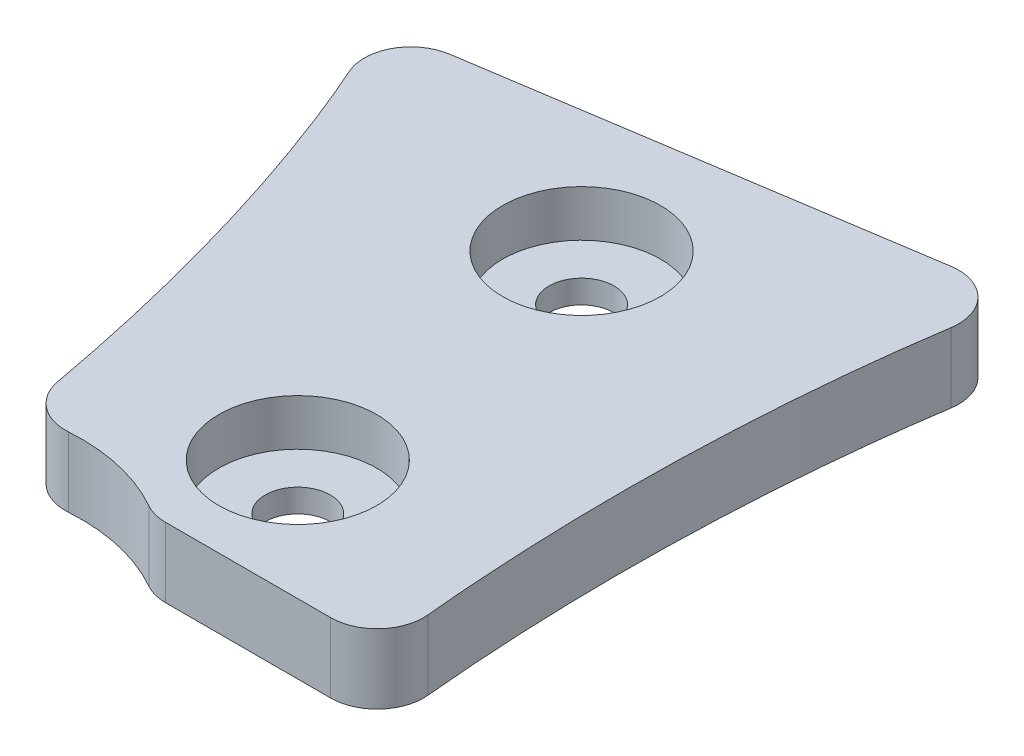
ISO-10303-21;
HEADER;
FILE_DESCRIPTION(('STEP AP214'),'2;1');
FILE_NAME('part.step','',(''),(''),'','','');
FILE_SCHEMA(('AUTOMOTIVE_DESIGN { 1 0 10303 214 1 1 1 1 }'));
ENDSEC;
DATA;
#1=APPLICATION_CONTEXT('core data for automotive mechanical design processes');
#2=APPLICATION_PROTOCOL_DEFINITION('international standard','automotive_design',2000,#1);
#3=PRODUCT_CONTEXT('',#1,'mechanical');
#4=PRODUCT('Part','Part','',(#3));
#5=PRODUCT_RELATED_PRODUCT_CATEGORY('part','',(#4));
#6=PRODUCT_DEFINITION_FORMATION('','',#4);
#7=PRODUCT_DEFINITION_CONTEXT('part definition',#1,'design');
#8=PRODUCT_DEFINITION('design','',#6,#7);
#9=PRODUCT_DEFINITION_SHAPE('','',#8);
#10=(LENGTH_UNIT() NAMED_UNIT(*) SI_UNIT(.MILLI.,.METRE.));
#11=(NAMED_UNIT(*) PLANE_ANGLE_UNIT() SI_UNIT($,.RADIAN.));
#12=(NAMED_UNIT(*) SI_UNIT($,.STERADIAN.) SOLID_ANGLE_UNIT());
#13=UNCERTAINTY_MEASURE_WITH_UNIT(LENGTH_MEASURE(1.E-05),#10,'distance_accuracy_value','');
#14=(GEOMETRIC_REPRESENTATION_CONTEXT(3) GLOBAL_UNCERTAINTY_ASSIGNED_CONTEXT((#13)) GLOBAL_UNIT_ASSIGNED_CONTEXT((#10,
#11,#12)) REPRESENTATION_CONTEXT('',''));
#15=CARTESIAN_POINT('',(0.,0.,0.));
#16=DIRECTION('',(0.,0.,1.));
#17=DIRECTION('',(1.,0.,0.));
#18=AXIS2_PLACEMENT_3D('',#15,#16,#17);
#19=CARTESIAN_POINT('',(49.8913924813645,13.5,-59.0924853869626));
#20=DIRECTION('',(0.,-1.,0.));
#21=DIRECTION('',(0.,0.,-1.));
#22=AXIS2_PLACEMENT_3D('',#19,#20,#21);
#23=CYLINDRICAL_SURFACE('',#22,0.700000000000001);
#24=CARTESIAN_POINT('',(49.8913924813645,12.,-59.0924853869626));
#25=DIRECTION('',(0.,1.,0.));
#26=DIRECTION('',(0.,0.,1.));
#27=AXIS2_PLACEMENT_3D('',#24,#25,#26);
#28=CIRCLE('',#27,0.700000000000001);
#29=CARTESIAN_POINT('',(49.8913924813645,12.,-58.3924853869626));
#30=VERTEX_POINT('',#29);
#31=EDGE_CURVE('E485',#30,#30,#28,.T.);
#32=ORIENTED_EDGE('',*,*,#31,.F.);
#33=EDGE_LOOP('',(#32));
#34=FACE_BOUND('',#33,.T.);
#35=CARTESIAN_POINT('',(49.8913924813645,12.5,-59.0924853869626));
#36=DIRECTION('',(0.,1.,0.));
#37=DIRECTION('',(0.,0.,1.));
#38=AXIS2_PLACEMENT_3D('',#35,#36,#37);
#39=CIRCLE('',#38,0.700000000000001);
#40=CARTESIAN_POINT('',(49.8913924813645,12.5,-58.3924853869626));
#41=VERTEX_POINT('',#40);
#42=EDGE_CURVE('E489',#41,#41,#39,.T.);
#43=ORIENTED_EDGE('',*,*,#42,.T.);
#44=EDGE_LOOP('',(#43));
#45=FACE_BOUND('',#44,.T.);
#46=ADVANCED_FACE('F374',(#34,#45),#23,.F.);
#47=CARTESIAN_POINT('',(49.0494062463612,13.5,-66.0453740570654));
#48=DIRECTION('',(0.,-1.,0.));
#49=DIRECTION('',(0.,0.,-1.));
#50=AXIS2_PLACEMENT_3D('',#47,#48,#49);
#51=CYLINDRICAL_SURFACE('',#50,0.700000000000023);
#52=CARTESIAN_POINT('',(49.0494062463612,12.,-66.0453740570654));
#53=DIRECTION('',(0.,1.,0.));
#54=DIRECTION('',(0.,0.,1.));
#55=AXIS2_PLACEMENT_3D('',#52,#53,#54);
#56=CIRCLE('',#55,0.700000000000023);
#57=CARTESIAN_POINT('',(49.0494062463612,12.,-65.3453740570654));
#58=VERTEX_POINT('',#57);
#59=EDGE_CURVE('E503',#58,#58,#56,.T.);
#60=ORIENTED_EDGE('',*,*,#59,.F.);
#61=EDGE_LOOP('',(#60));
#62=FACE_BOUND('',#61,.T.);
#63=CARTESIAN_POINT('',(49.0494062463612,12.5,-66.0453740570654));
#64=DIRECTION('',(0.,1.,0.));
#65=DIRECTION('',(0.,0.,1.));
#66=AXIS2_PLACEMENT_3D('',#63,#64,#65);
#67=CIRCLE('',#66,0.700000000000023);
#68=CARTESIAN_POINT('',(49.0494062463612,12.5,-65.3453740570654));
#69=VERTEX_POINT('',#68);
#70=EDGE_CURVE('E497',#69,#69,#67,.T.);
#71=ORIENTED_EDGE('',*,*,#70,.T.);
#72=EDGE_LOOP('',(#71));
#73=FACE_BOUND('',#72,.T.);
#74=ADVANCED_FACE('F589',(#62,#73),#51,.F.);
#75=CARTESIAN_POINT('',(53.9907029686988,13.5,-63.2436286120206));
#76=DIRECTION('',(0.,1.,0.));
#77=DIRECTION('',(0.,0.,1.));
#78=AXIS2_PLACEMENT_3D('',#75,#76,#77);
#79=PLANE('',#78);
#80=CARTESIAN_POINT('',(49.0494062463612,13.5,-66.0453740570654));
#81=DIRECTION('',(0.,1.,0.));
#82=DIRECTION('',(0.,0.,1.));
#83=AXIS2_PLACEMENT_3D('',#80,#81,#82);
#84=CIRCLE('',#83,1.70000000000002);
#85=CARTESIAN_POINT('',(49.0494062463612,13.5,-64.3453740570654));
#86=VERTEX_POINT('',#85);
#87=EDGE_CURVE('E505',#86,#86,#84,.T.);
#88=ORIENTED_EDGE('',*,*,#87,.F.);
#89=EDGE_LOOP('',(#88));
#90=FACE_BOUND('',#89,.T.);
#91=CARTESIAN_POINT('',(49.8913924813645,13.5,-59.0924853869626));
#92=DIRECTION('',(0.,1.,0.));
#93=DIRECTION('',(0.,0.,1.));
#94=AXIS2_PLACEMENT_3D('',#91,#92,#93);
#95=CIRCLE('',#94,1.7);
#96=CARTESIAN_POINT('',(49.8913924813645,13.5,-57.3924853869626));
#97=VERTEX_POINT('',#96);
#98=EDGE_CURVE('E515',#97,#97,#95,.T.);
#99=ORIENTED_EDGE('',*,*,#98,.F.);
#100=EDGE_LOOP('',(#99));
#101=FACE_BOUND('',#100,.T.);
#102=CARTESIAN_POINT('',(54.4554315101539,13.5,-68.5990260310877));
#103=CARTESIAN_POINT('',(54.3545266783001,13.5,-67.9382398829169));
#104=CARTESIAN_POINT('',(54.271624139511,13.5,-67.2755397016494));
#105=CARTESIAN_POINT('',(54.0904122714855,13.5,-65.4931823189875));
#106=CARTESIAN_POINT('',(54.0206159285442,13.5,-64.3698355688438));
#107=CARTESIAN_POINT('',(53.9607900088534,13.5,-62.1174216551974));
#108=CARTESIAN_POINT('',(53.9712566464364,13.5,-60.9929785765451));
#109=CARTESIAN_POINT('',(54.0558564716273,13.5,-59.1136931290327));
#110=CARTESIAN_POINT('',(54.108016376755,13.5,-58.3578909142161));
#111=CARTESIAN_POINT('',(54.1802532483283,13.5,-57.6029657096994));
#112=B_SPLINE_CURVE_WITH_KNOTS('',3,(#102,#103,#104,#105,#106,#107,#108,#109,#110,#111),
.UNSPECIFIED.,.F.,.F.,(4,2,2,2,4),(0.0815226926668174,0.230073441329148,0.480073441329148,
0.730073441329148,0.898550748662329),.UNSPECIFIED.);
#113=CARTESIAN_POINT('',(54.1802645645021,13.5,-57.6029667925153));
#114=VERTEX_POINT('',#113);
#115=CARTESIAN_POINT('',(54.455467883606,13.5,-68.5990204767081));
#116=VERTEX_POINT('',#115);
#117=EDGE_CURVE('E566',#114,#116,#112,.F.);
#118=ORIENTED_EDGE('',*,*,#117,.T.);
#119=CARTESIAN_POINT('',(53.4668907733742,13.5,-68.7499803676503));
#120=DIRECTION('',(0.,1.,0.));
#121=DIRECTION('',(0.,0.,1.));
#122=AXIS2_PLACEMENT_3D('',#119,#120,#121);
#123=CIRCLE('',#122,1.);
#124=CARTESIAN_POINT('',(53.3145344428725,13.5,-69.7383059964569));
#125=VERTEX_POINT('',#124);
#126=EDGE_CURVE('E673',#116,#125,#123,.T.);
#127=ORIENTED_EDGE('',*,*,#126,.T.);
#128=DIRECTION('',(-0.988325628806664,0.,0.152356330501599));
#129=VECTOR('',#128,1.);
#130=CARTESIAN_POINT('',(54.6881930936967,13.5,-69.9500637261984));
#131=LINE('',#130,#129);
#132=CARTESIAN_POINT('',(43.9579178396539,13.5,-68.295927361292));
#133=VERTEX_POINT('',#132);
#134=EDGE_CURVE('E473',#125,#133,#131,.T.);
#135=ORIENTED_EDGE('',*,*,#134,.T.);
#136=CARTESIAN_POINT('',(44.1102741701555,13.5,-67.3076017324853));
#137=DIRECTION('',(0.,1.,0.));
#138=DIRECTION('',(0.,0.,1.));
#139=AXIS2_PLACEMENT_3D('',#136,#137,#138);
#140=CIRCLE('',#139,1.);
#141=CARTESIAN_POINT('',(43.1958168084121,13.5,-66.9026871975463));
#142=VERTEX_POINT('',#141);
#143=EDGE_CURVE('E719',#133,#142,#140,.T.);
#144=ORIENTED_EDGE('',*,*,#143,.T.);
#145=CARTESIAN_POINT('',(45.8459208388537,13.5,-57.967576905918));
#146=CARTESIAN_POINT('',(45.5534349954706,13.5,-59.5718323272755));
#147=CARTESIAN_POINT('',(45.1790006364089,13.5,-61.1600553445394));
#148=CARTESIAN_POINT('',(44.4352139604292,13.5,-63.6641010179501));
#149=CARTESIAN_POINT('',(44.1234133913989,13.5,-64.5925800214781));
#150=CARTESIAN_POINT('',(43.5913922741165,13.5,-65.9755087098045));
#151=CARTESIAN_POINT('',(43.4000706027265,13.5,-66.4416334675884));
#152=CARTESIAN_POINT('',(43.195902776793,13.5,-66.9027252636702));
#153=B_SPLINE_CURVE_WITH_KNOTS('',3,(#145,#146,#147,#148,#149,#150,#151,#152),.UNSPECIFIED.,.F.,
.F.,(4,2,2,4),(0.121205951813133,0.53684669898772,0.78684669898772,0.915640747174587),.UNSPECIFIED.);
#154=CARTESIAN_POINT('',(45.8459266689806,13.5,-57.9675779688594));
#155=VERTEX_POINT('',#154);
#156=EDGE_CURVE('E611',#142,#155,#153,.F.);
#157=ORIENTED_EDGE('',*,*,#156,.T.);
#158=CARTESIAN_POINT('',(46.8297039620861,13.5,-58.1469390157493));
#159=DIRECTION('',(0.,1.,0.));
#160=DIRECTION('',(0.,0.,1.));
#161=AXIS2_PLACEMENT_3D('',#158,#159,#160);
#162=CIRCLE('',#161,1.);
#163=CARTESIAN_POINT('',(46.8968852972062,13.5,-57.1491982336764));
#164=VERTEX_POINT('',#163);
#165=EDGE_CURVE('E722',#155,#164,#162,.T.);
#166=ORIENTED_EDGE('',*,*,#165,.T.);
#167=CARTESIAN_POINT('',(47.1656106376869,13.5,-53.1582351053848));
#168=DIRECTION('',(0.,-1.,0.));
#169=DIRECTION('',(0.,0.,1.));
#170=AXIS2_PLACEMENT_3D('',#167,#168,#169);
#171=CIRCLE('',#170,4.00000000000001);
#172=CARTESIAN_POINT('',(49.1385538865381,13.5,-56.6378176862143));
#173=VERTEX_POINT('',#172);
#174=EDGE_CURVE('E619',#164,#173,#171,.T.);
#175=ORIENTED_EDGE('',*,*,#174,.T.);
#176=CARTESIAN_POINT('',(49.6317896987509,13.5,-57.5077133314217));
#177=DIRECTION('',(0.,1.,0.));
#178=DIRECTION('',(0.,0.,1.));
#179=AXIS2_PLACEMENT_3D('',#176,#177,#178);
#180=CIRCLE('',#179,1.);
#181=CARTESIAN_POINT('',(49.6317896987509,13.5,-56.5077133314217));
#182=VERTEX_POINT('',#181);
#183=EDGE_CURVE('E397',#173,#182,#180,.T.);
#184=ORIENTED_EDGE('',*,*,#183,.T.);
#185=DIRECTION('',(1.,0.,0.));
#186=VECTOR('',#185,1.);
#187=CARTESIAN_POINT('',(49.3521594282023,13.5,-56.5077133314217));
#188=LINE('',#187,#186);
#189=CARTESIAN_POINT('',(53.1848000930104,13.5,-56.5077133314217));
#190=VERTEX_POINT('',#189);
#191=EDGE_CURVE('E621',#182,#190,#188,.T.);
#192=ORIENTED_EDGE('',*,*,#191,.T.);
#193=CARTESIAN_POINT('',(53.1848000930104,13.5,-57.5077133314217));
#194=DIRECTION('',(0.,1.,0.));
#195=DIRECTION('',(0.,0.,1.));
#196=AXIS2_PLACEMENT_3D('',#193,#194,#195);
#197=CIRCLE('',#196,1.);
#198=EDGE_CURVE('E675',#190,#114,#197,.T.);
#199=ORIENTED_EDGE('',*,*,#198,.T.);
#200=EDGE_LOOP('',(#118,#127,#135,#144,#157,#166,#175,#184,#192,#199));
#201=FACE_BOUND('',#200,.T.);
#202=ADVANCED_FACE('F580',(#90,#101,#201),#79,.T.);
#203=CARTESIAN_POINT('',(53.9907029686988,12.,-63.2436286120206));
#204=DIRECTION('',(0.,1.,0.));
#205=DIRECTION('',(0.,0.,1.));
#206=AXIS2_PLACEMENT_3D('',#203,#204,#205);
#207=PLANE('',#206);
#208=DIRECTION('',(-0.988325628806664,0.,0.152356330501599));
#209=VECTOR('',#208,1.);
#210=CARTESIAN_POINT('',(54.6881930936967,12.,-69.9500637261984));
#211=LINE('',#210,#209);
#212=CARTESIAN_POINT('',(53.3145344428725,12.,-69.7383059964569));
#213=VERTEX_POINT('',#212);
#214=CARTESIAN_POINT('',(43.9579178396539,12.,-68.295927361292));
#215=VERTEX_POINT('',#214);
#216=EDGE_CURVE('E470',#213,#215,#211,.T.);
#217=ORIENTED_EDGE('',*,*,#216,.F.);
#218=CARTESIAN_POINT('',(53.4668907733742,12.,-68.7499803676503));
#219=DIRECTION('',(0.,1.,0.));
#220=DIRECTION('',(0.,0.,1.));
#221=AXIS2_PLACEMENT_3D('',#218,#219,#220);
#222=CIRCLE('',#221,1.);
#223=CARTESIAN_POINT('',(54.4554725657132,12.,-68.5990197616412));
#224=VERTEX_POINT('',#223);
#225=EDGE_CURVE('E453',#213,#224,#222,.F.);
#226=ORIENTED_EDGE('',*,*,#225,.T.);
#227=CARTESIAN_POINT('',(54.1802532482786,12.,-57.6029657102187));
#228=CARTESIAN_POINT('',(54.1080163767311,12.,-58.3578909145627));
#229=CARTESIAN_POINT('',(54.0558564716195,12.,-59.1136931292061));
#230=CARTESIAN_POINT('',(53.9712566464364,12.,-60.9929785765451));
#231=CARTESIAN_POINT('',(53.9607900088534,12.,-62.1174216551974));
#232=CARTESIAN_POINT('',(54.0206159285442,12.,-64.3698355688438));
#233=CARTESIAN_POINT('',(54.0904122714855,12.,-65.4931823189875));
#234=CARTESIAN_POINT('',(54.2716241394551,12.,-67.2755397010994));
#235=CARTESIAN_POINT('',(54.3545266781628,12.,-67.9382398818197));
#236=CARTESIAN_POINT('',(54.4554315099033,12.,-68.5990260294466));
#237=B_SPLINE_CURVE_WITH_KNOTS('',3,(#227,#228,#229,#230,#231,#232,#233,#234,#235,#236),
.UNSPECIFIED.,.F.,.F.,(4,2,2,2,4),(0.0815226927054477,0.249999999999999,0.499999999999998,
0.749999999999999,0.898550748539358),.UNSPECIFIED.);
#238=CARTESIAN_POINT('',(54.1802615436658,12.,-57.602966503866));
#239=VERTEX_POINT('',#238);
#240=EDGE_CURVE('E481',#239,#224,#237,.T.);
#241=ORIENTED_EDGE('',*,*,#240,.F.);
#242=CARTESIAN_POINT('',(53.1848000930104,12.,-57.5077133314217));
#243=DIRECTION('',(0.,1.,0.));
#244=DIRECTION('',(0.,0.,1.));
#245=AXIS2_PLACEMENT_3D('',#242,#243,#244);
#246=CIRCLE('',#245,1.);
#247=CARTESIAN_POINT('',(53.1848000930104,12.,-56.5077133314217));
#248=VERTEX_POINT('',#247);
#249=EDGE_CURVE('E464',#239,#248,#246,.F.);
#250=ORIENTED_EDGE('',*,*,#249,.T.);
#251=DIRECTION('',(1.,0.,0.));
#252=VECTOR('',#251,1.);
#253=CARTESIAN_POINT('',(49.3521594282023,12.,-56.5077133314217));
#254=LINE('',#253,#252);
#255=CARTESIAN_POINT('',(49.6317896987509,12.,-56.5077133314217));
#256=VERTEX_POINT('',#255);
#257=EDGE_CURVE('E564',#256,#248,#254,.T.);
#258=ORIENTED_EDGE('',*,*,#257,.F.);
#259=CARTESIAN_POINT('',(49.6317896987509,12.,-57.5077133314217));
#260=DIRECTION('',(0.,1.,0.));
#261=DIRECTION('',(0.,0.,1.));
#262=AXIS2_PLACEMENT_3D('',#259,#260,#261);
#263=CIRCLE('',#262,1.);
#264=CARTESIAN_POINT('',(49.1385538865381,12.,-56.6378176862143));
#265=VERTEX_POINT('',#264);
#266=EDGE_CURVE('E707',#256,#265,#263,.F.);
#267=ORIENTED_EDGE('',*,*,#266,.T.);
#268=CARTESIAN_POINT('',(47.1656106376869,12.,-53.1582351053848));
#269=DIRECTION('',(0.,-1.,0.));
#270=DIRECTION('',(0.,0.,1.));
#271=AXIS2_PLACEMENT_3D('',#268,#269,#270);
#272=CIRCLE('',#271,4.00000000000001);
#273=CARTESIAN_POINT('',(46.8968852972062,12.,-57.1491982336764));
#274=VERTEX_POINT('',#273);
#275=EDGE_CURVE('E484',#274,#265,#272,.T.);
#276=ORIENTED_EDGE('',*,*,#275,.F.);
#277=CARTESIAN_POINT('',(46.8297039620861,12.,-58.1469390157493));
#278=DIRECTION('',(0.,1.,0.));
#279=DIRECTION('',(0.,0.,1.));
#280=AXIS2_PLACEMENT_3D('',#277,#278,#279);
#281=CIRCLE('',#280,1.);
#282=CARTESIAN_POINT('',(45.8459250469996,12.,-57.9675776733775));
#283=VERTEX_POINT('',#282);
#284=EDGE_CURVE('E701',#274,#283,#281,.F.);
#285=ORIENTED_EDGE('',*,*,#284,.T.);
#286=CARTESIAN_POINT('',(43.1959027777842,12.,-66.9027252614316));
#287=CARTESIAN_POINT('',(43.4000706033457,12.,-66.4416334660797));
#288=CARTESIAN_POINT('',(43.5913922744092,12.,-65.9755087090435));
#289=CARTESIAN_POINT('',(44.1234133913989,12.,-64.5925800214781));
#290=CARTESIAN_POINT('',(44.4352139604292,12.,-63.6641010179501));
#291=CARTESIAN_POINT('',(45.1790006363814,12.,-61.1600553446319));
#292=CARTESIAN_POINT('',(45.5534349954263,12.,-59.5718323274636));
#293=CARTESIAN_POINT('',(45.8459208388017,12.,-57.9675769062029));
#294=B_SPLINE_CURVE_WITH_KNOTS('',3,(#286,#287,#288,#289,#290,#291,#292,#293),.UNSPECIFIED.,.F.,
.F.,(4,2,2,4),(0.121205952021565,0.25,0.5,0.915640747149978),.UNSPECIFIED.);
#295=CARTESIAN_POINT('',(43.1958228972712,12.,-66.9026898910082));
#296=VERTEX_POINT('',#295);
#297=EDGE_CURVE('E480',#296,#283,#294,.T.);
#298=ORIENTED_EDGE('',*,*,#297,.F.);
#299=CARTESIAN_POINT('',(44.1102741701555,12.,-67.3076017324853));
#300=DIRECTION('',(0.,1.,0.));
#301=DIRECTION('',(0.,0.,1.));
#302=AXIS2_PLACEMENT_3D('',#299,#300,#301);
#303=CIRCLE('',#302,1.);
#304=EDGE_CURVE('E474',#296,#215,#303,.F.);
#305=ORIENTED_EDGE('',*,*,#304,.T.);
#306=EDGE_LOOP('',(#217,#226,#241,#250,#258,#267,#276,#285,#298,#305));
#307=FACE_BOUND('',#306,.T.);
#308=ORIENTED_EDGE('',*,*,#31,.T.);
#309=EDGE_LOOP('',(#308));
#310=FACE_BOUND('',#309,.T.);
#311=ORIENTED_EDGE('',*,*,#59,.T.);
#312=EDGE_LOOP('',(#311));
#313=FACE_BOUND('',#312,.T.);
#314=ADVANCED_FACE('F477',(#307,#310,#313),#207,.F.);
#315=CARTESIAN_POINT('',(54.2994414012508,13.5,-56.5077133314217));
#316=CARTESIAN_POINT('',(54.1627325827121,13.5,-57.6266418472396));
#317=CARTESIAN_POINT('',(54.0723371873742,13.5,-58.7475934450448));
#318=CARTESIAN_POINT('',(53.9712566464364,13.5,-60.9929785765451));
#319=CARTESIAN_POINT('',(53.9607900088534,13.5,-62.1174216551974));
#320=CARTESIAN_POINT('',(54.0206159285442,13.5,-64.3698355688438));
#321=CARTESIAN_POINT('',(54.0904122714855,13.5,-65.4931823189875));
#322=CARTESIAN_POINT('',(54.3177507831226,13.5,-67.7292305369924));
#323=CARTESIAN_POINT('',(54.4749230649993,13.5,-68.8426293334649));
#324=CARTESIAN_POINT('',(54.6881930936967,13.5,-69.9500637261983));
#325=B_SPLINE_CURVE_WITH_KNOTS('',3,(#315,#316,#317,#318,#319,#320,#321,#322,#323,#324),
.UNSPECIFIED.,.F.,.F.,(4,2,2,2,4),(0.,0.249999999999999,0.499999999999998,0.749999999999999,1.),.UNSPECIFIED.);
#326=DIRECTION('',(0.,-1.,0.));
#327=VECTOR('',#326,1.);
#328=SURFACE_OF_LINEAR_EXTRUSION('',#325,#327);
#329=ORIENTED_EDGE('',*,*,#240,.T.);
#330=DIRECTION('',(0.,-1.,0.));
#331=VECTOR('',#330,1.);
#332=CARTESIAN_POINT('',(54.455431509666,12.,-68.599026027893));
#333=LINE('',#332,#331);
#334=EDGE_CURVE('E458',#224,#116,#333,.F.);
#335=ORIENTED_EDGE('',*,*,#334,.T.);
#336=ORIENTED_EDGE('',*,*,#117,.F.);
#337=DIRECTION('',(0.,-1.,0.));
#338=VECTOR('',#337,1.);
#339=CARTESIAN_POINT('',(54.1802532482564,13.5,-57.6029657104511));
#340=LINE('',#339,#338);
#341=EDGE_CURVE('E463',#114,#239,#340,.T.);
#342=ORIENTED_EDGE('',*,*,#341,.T.);
#343=EDGE_LOOP('',(#329,#335,#336,#342));
#344=FACE_BOUND('',#343,.T.);
#345=ADVANCED_FACE('F534',(#344),#328,.F.);
#346=CARTESIAN_POINT('',(54.6881930936967,13.5,-69.9500637261984));
#347=DIRECTION('',(0.152356330501599,0.,0.988325628806664));
#348=DIRECTION('',(0.988325628806664,0.,-0.152356330501599));
#349=AXIS2_PLACEMENT_3D('',#346,#347,#348);
#350=PLANE('',#349);
#351=ORIENTED_EDGE('',*,*,#134,.F.);
#352=DIRECTION('',(0.,-1.,0.));
#353=VECTOR('',#352,1.);
#354=CARTESIAN_POINT('',(53.3145344428725,13.5,-69.7383059964569));
#355=LINE('',#354,#353);
#356=EDGE_CURVE('E457',#125,#213,#355,.T.);
#357=ORIENTED_EDGE('',*,*,#356,.T.);
#358=ORIENTED_EDGE('',*,*,#216,.T.);
#359=DIRECTION('',(0.,-1.,0.));
#360=VECTOR('',#359,1.);
#361=CARTESIAN_POINT('',(43.9579178396539,13.5,-68.295927361292));
#362=LINE('',#361,#360);
#363=EDGE_CURVE('E475',#215,#133,#362,.F.);
#364=ORIENTED_EDGE('',*,*,#363,.T.);
#365=EDGE_LOOP('',(#351,#357,#358,#364));
#366=FACE_BOUND('',#365,.T.);
#367=ADVANCED_FACE('F469',(#366),#350,.F.);
#368=CARTESIAN_POINT('',(42.5833399463783,13.5,-68.1903413702174));
#369=CARTESIAN_POINT('',(43.0307351532528,13.5,-67.3153394962351));
#370=CARTESIAN_POINT('',(43.4211569543865,13.5,-66.4180161588011));
#371=CARTESIAN_POINT('',(44.1234133913989,13.5,-64.5925800214781));
#372=CARTESIAN_POINT('',(44.4352139604292,13.5,-63.6641010179501));
#373=CARTESIAN_POINT('',(45.2732636281405,13.5,-60.8427078519974));
#374=CARTESIAN_POINT('',(45.7017193246304,13.5,-58.9261195940438));
#375=CARTESIAN_POINT('',(46.0139514081713,13.5,-56.9888592084614));
#376=B_SPLINE_CURVE_WITH_KNOTS('',3,(#368,#369,#370,#371,#372,#373,#374,#375),.UNSPECIFIED.,.F.,
.F.,(4,2,2,4),(0.,0.25,0.5,1.),.UNSPECIFIED.);
#377=DIRECTION('',(0.,-1.,0.));
#378=VECTOR('',#377,1.);
#379=SURFACE_OF_LINEAR_EXTRUSION('',#376,#378);
#380=ORIENTED_EDGE('',*,*,#297,.T.);
#381=DIRECTION('',(0.,-1.,0.));
#382=VECTOR('',#381,1.);
#383=CARTESIAN_POINT('',(45.8459208387914,12.,-57.9675769062598));
#384=LINE('',#383,#382);
#385=EDGE_CURVE('E12',#283,#155,#384,.F.);
#386=ORIENTED_EDGE('',*,*,#385,.T.);
#387=ORIENTED_EDGE('',*,*,#156,.F.);
#388=DIRECTION('',(0.,-1.,0.));
#389=VECTOR('',#388,1.);
#390=CARTESIAN_POINT('',(43.1959027777859,13.5,-66.9027252614277));
#391=LINE('',#390,#389);
#392=EDGE_CURVE('E383',#142,#296,#391,.T.);
#393=ORIENTED_EDGE('',*,*,#392,.T.);
#394=EDGE_LOOP('',(#380,#386,#387,#393));
#395=FACE_BOUND('',#394,.T.);
#396=ADVANCED_FACE('F626',(#395),#379,.F.);
#397=CARTESIAN_POINT('',(47.1656106376869,13.5,-53.1582351053848));
#398=DIRECTION('',(0.,-1.,0.));
#399=DIRECTION('',(0.,0.,-1.));
#400=AXIS2_PLACEMENT_3D('',#397,#398,#399);
#401=CYLINDRICAL_SURFACE('',#400,4.00000000000001);
#402=ORIENTED_EDGE('',*,*,#275,.T.);
#403=DIRECTION('',(0.,-1.,0.));
#404=VECTOR('',#403,1.);
#405=CARTESIAN_POINT('',(49.1385538865381,13.5,-56.6378176862143));
#406=LINE('',#405,#404);
#407=EDGE_CURVE('E693',#265,#173,#406,.F.);
#408=ORIENTED_EDGE('',*,*,#407,.T.);
#409=ORIENTED_EDGE('',*,*,#174,.F.);
#410=DIRECTION('',(0.,-1.,0.));
#411=VECTOR('',#410,1.);
#412=CARTESIAN_POINT('',(46.8968852972062,13.5,-57.1491982336764));
#413=LINE('',#412,#411);
#414=EDGE_CURVE('E690',#164,#274,#413,.T.);
#415=ORIENTED_EDGE('',*,*,#414,.T.);
#416=EDGE_LOOP('',(#402,#408,#409,#415));
#417=FACE_BOUND('',#416,.T.);
#418=ADVANCED_FACE('F635',(#417),#401,.F.);
#419=CARTESIAN_POINT('',(49.3521594282023,13.5,-56.5077133314217));
#420=DIRECTION('',(0.,0.,-1.));
#421=DIRECTION('',(-1.,0.,0.));
#422=AXIS2_PLACEMENT_3D('',#419,#420,#421);
#423=PLANE('',#422);
#424=ORIENTED_EDGE('',*,*,#257,.T.);
#425=DIRECTION('',(0.,-1.,0.));
#426=VECTOR('',#425,1.);
#427=CARTESIAN_POINT('',(53.1848000930104,13.5,-56.5077133314217));
#428=LINE('',#427,#426);
#429=EDGE_CURVE('E390',#248,#190,#428,.F.);
#430=ORIENTED_EDGE('',*,*,#429,.T.);
#431=ORIENTED_EDGE('',*,*,#191,.F.);
#432=DIRECTION('',(0.,-1.,0.));
#433=VECTOR('',#432,1.);
#434=CARTESIAN_POINT('',(49.6317896987509,13.5,-56.5077133314217));
#435=LINE('',#434,#433);
#436=EDGE_CURVE('E679',#182,#256,#435,.T.);
#437=ORIENTED_EDGE('',*,*,#436,.T.);
#438=EDGE_LOOP('',(#424,#430,#431,#437));
#439=FACE_BOUND('',#438,.T.);
#440=ADVANCED_FACE('F638',(#439),#423,.F.);
#441=CARTESIAN_POINT('',(49.0494062463612,12.5,-66.0453740570654));
#442=DIRECTION('',(0.,1.,0.));
#443=DIRECTION('',(0.,0.,1.));
#444=AXIS2_PLACEMENT_3D('',#441,#442,#443);
#445=CYLINDRICAL_SURFACE('',#444,1.70000000000002);
#446=CARTESIAN_POINT('',(49.0494062463612,12.5,-66.0453740570654));
#447=DIRECTION('',(0.,1.,0.));
#448=DIRECTION('',(0.,0.,1.));
#449=AXIS2_PLACEMENT_3D('',#446,#447,#448);
#450=CIRCLE('',#449,1.70000000000002);
#451=CARTESIAN_POINT('',(49.0494062463612,12.5,-64.3453740570654));
#452=VERTEX_POINT('',#451);
#453=EDGE_CURVE('E499',#452,#452,#450,.T.);
#454=ORIENTED_EDGE('',*,*,#453,.F.);
#455=EDGE_LOOP('',(#454));
#456=FACE_BOUND('',#455,.T.);
#457=ORIENTED_EDGE('',*,*,#87,.T.);
#458=EDGE_LOOP('',(#457));
#459=FACE_BOUND('',#458,.T.);
#460=ADVANCED_FACE('F641',(#456,#459),#445,.F.);
#461=CARTESIAN_POINT('',(49.0494062463612,12.5,-66.0453740570654));
#462=DIRECTION('',(0.,1.,0.));
#463=DIRECTION('',(0.,0.,1.));
#464=AXIS2_PLACEMENT_3D('',#461,#462,#463);
#465=PLANE('',#464);
#466=ORIENTED_EDGE('',*,*,#70,.F.);
#467=EDGE_LOOP('',(#466));
#468=FACE_BOUND('',#467,.T.);
#469=ORIENTED_EDGE('',*,*,#453,.T.);
#470=EDGE_LOOP('',(#469));
#471=FACE_BOUND('',#470,.T.);
#472=ADVANCED_FACE('F646',(#468,#471),#465,.T.);
#473=CARTESIAN_POINT('',(49.8913924813645,12.5,-59.0924853869626));
#474=DIRECTION('',(0.,1.,0.));
#475=DIRECTION('',(0.,0.,1.));
#476=AXIS2_PLACEMENT_3D('',#473,#474,#475);
#477=CYLINDRICAL_SURFACE('',#476,1.7);
#478=CARTESIAN_POINT('',(49.8913924813645,12.5,-59.0924853869626));
#479=DIRECTION('',(0.,1.,0.));
#480=DIRECTION('',(0.,0.,1.));
#481=AXIS2_PLACEMENT_3D('',#478,#479,#480);
#482=CIRCLE('',#481,1.7);
#483=CARTESIAN_POINT('',(49.8913924813645,12.5,-57.3924853869626));
#484=VERTEX_POINT('',#483);
#485=EDGE_CURVE('E510',#484,#484,#482,.T.);
#486=ORIENTED_EDGE('',*,*,#485,.F.);
#487=EDGE_LOOP('',(#486));
#488=FACE_BOUND('',#487,.T.);
#489=ORIENTED_EDGE('',*,*,#98,.T.);
#490=EDGE_LOOP('',(#489));
#491=FACE_BOUND('',#490,.T.);
#492=ADVANCED_FACE('F662',(#488,#491),#477,.F.);
#493=CARTESIAN_POINT('',(49.8913924813645,12.5,-59.0924853869626));
#494=DIRECTION('',(0.,1.,0.));
#495=DIRECTION('',(0.,0.,1.));
#496=AXIS2_PLACEMENT_3D('',#493,#494,#495);
#497=PLANE('',#496);
#498=ORIENTED_EDGE('',*,*,#42,.F.);
#499=EDGE_LOOP('',(#498));
#500=FACE_BOUND('',#499,.T.);
#501=ORIENTED_EDGE('',*,*,#485,.T.);
#502=EDGE_LOOP('',(#501));
#503=FACE_BOUND('',#502,.T.);
#504=ADVANCED_FACE('F659',(#500,#503),#497,.T.);
#505=CARTESIAN_POINT('',(53.4668907733742,12.75,-68.7499803676503));
#506=DIRECTION('',(0.,-1.,0.));
#507=DIRECTION('',(0.,0.,-1.));
#508=AXIS2_PLACEMENT_3D('',#505,#506,#507);
#509=CYLINDRICAL_SURFACE('',#508,1.);
#510=ORIENTED_EDGE('',*,*,#126,.F.);
#511=ORIENTED_EDGE('',*,*,#334,.F.);
#512=ORIENTED_EDGE('',*,*,#225,.F.);
#513=ORIENTED_EDGE('',*,*,#356,.F.);
#514=EDGE_LOOP('',(#510,#511,#512,#513));
#515=FACE_BOUND('',#514,.T.);
#516=ADVANCED_FACE('F456',(#515),#509,.T.);
#517=CARTESIAN_POINT('',(53.1848000930104,12.75,-57.5077133314217));
#518=DIRECTION('',(0.,-1.,0.));
#519=DIRECTION('',(0.,0.,-1.));
#520=AXIS2_PLACEMENT_3D('',#517,#518,#519);
#521=CYLINDRICAL_SURFACE('',#520,1.);
#522=ORIENTED_EDGE('',*,*,#198,.F.);
#523=ORIENTED_EDGE('',*,*,#429,.F.);
#524=ORIENTED_EDGE('',*,*,#249,.F.);
#525=ORIENTED_EDGE('',*,*,#341,.F.);
#526=EDGE_LOOP('',(#522,#523,#524,#525));
#527=FACE_BOUND('',#526,.T.);
#528=ADVANCED_FACE('F717',(#527),#521,.T.);
#529=CARTESIAN_POINT('',(49.6317896987509,13.5,-57.5077133314217));
#530=DIRECTION('',(0.,-1.,0.));
#531=DIRECTION('',(0.,0.,-1.));
#532=AXIS2_PLACEMENT_3D('',#529,#530,#531);
#533=CYLINDRICAL_SURFACE('',#532,1.);
#534=ORIENTED_EDGE('',*,*,#183,.F.);
#535=ORIENTED_EDGE('',*,*,#407,.F.);
#536=ORIENTED_EDGE('',*,*,#266,.F.);
#537=ORIENTED_EDGE('',*,*,#436,.F.);
#538=EDGE_LOOP('',(#534,#535,#536,#537));
#539=FACE_BOUND('',#538,.T.);
#540=ADVANCED_FACE('F735',(#539),#533,.T.);
#541=CARTESIAN_POINT('',(46.8297039620861,12.75,-58.1469390157493));
#542=DIRECTION('',(0.,-1.,0.));
#543=DIRECTION('',(0.,0.,-1.));
#544=AXIS2_PLACEMENT_3D('',#541,#542,#543);
#545=CYLINDRICAL_SURFACE('',#544,1.);
#546=ORIENTED_EDGE('',*,*,#165,.F.);
#547=ORIENTED_EDGE('',*,*,#385,.F.);
#548=ORIENTED_EDGE('',*,*,#284,.F.);
#549=ORIENTED_EDGE('',*,*,#414,.F.);
#550=EDGE_LOOP('',(#546,#547,#548,#549));
#551=FACE_BOUND('',#550,.T.);
#552=ADVANCED_FACE('F733',(#551),#545,.T.);
#553=CARTESIAN_POINT('',(44.1102741701555,12.75,-67.3076017324853));
#554=DIRECTION('',(0.,-1.,0.));
#555=DIRECTION('',(0.,0.,-1.));
#556=AXIS2_PLACEMENT_3D('',#553,#554,#555);
#557=CYLINDRICAL_SURFACE('',#556,1.);
#558=ORIENTED_EDGE('',*,*,#143,.F.);
#559=ORIENTED_EDGE('',*,*,#363,.F.);
#560=ORIENTED_EDGE('',*,*,#304,.F.);
#561=ORIENTED_EDGE('',*,*,#392,.F.);
#562=EDGE_LOOP('',(#558,#559,#560,#561));
#563=FACE_BOUND('',#562,.T.);
#564=ADVANCED_FACE('F376',(#563),#557,.T.);
#565=CLOSED_SHELL('',(#46,#74,#202,#314,#345,#367,#396,#418,#440,#460,#472,#492,#504,#516,#528,
#540,#552,#564));
#566=MANIFOLD_SOLID_BREP('B2',#565);
#567=ADVANCED_BREP_SHAPE_REPRESENTATION('',(#18,#566),#14);
#568=SHAPE_DEFINITION_REPRESENTATION(#9,#567);
ENDSEC;
END-ISO-10303-21;
